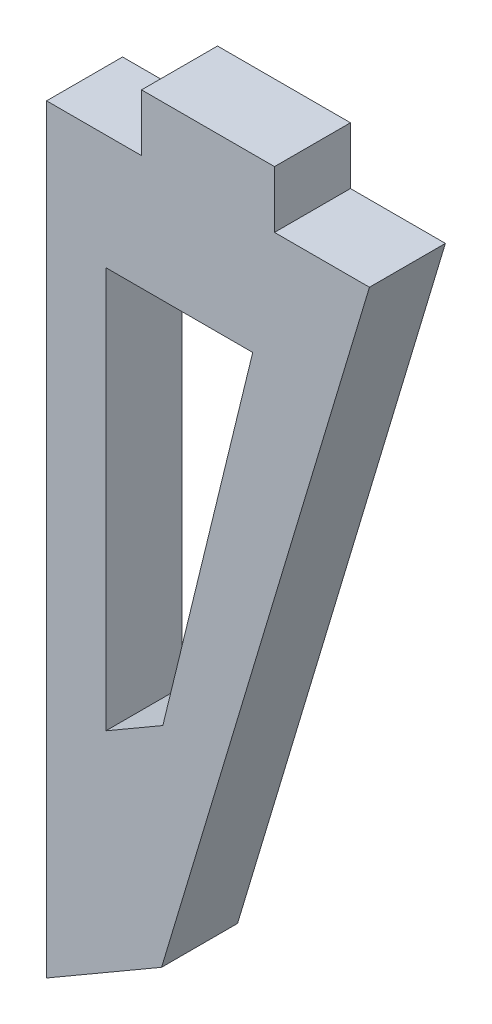
ISO-10303-21;
HEADER;
FILE_DESCRIPTION(('STEP AP214'),'2;1');
FILE_NAME('part.step','',(''),(''),'','','');
FILE_SCHEMA(('AUTOMOTIVE_DESIGN { 1 0 10303 214 1 1 1 1 }'));
ENDSEC;
DATA;
#1=APPLICATION_CONTEXT('core data for automotive mechanical design processes');
#2=APPLICATION_PROTOCOL_DEFINITION('international standard','automotive_design',2000,#1);
#3=PRODUCT_CONTEXT('',#1,'mechanical');
#4=PRODUCT('Part','Part','',(#3));
#5=PRODUCT_RELATED_PRODUCT_CATEGORY('part','',(#4));
#6=PRODUCT_DEFINITION_FORMATION('','',#4);
#7=PRODUCT_DEFINITION_CONTEXT('part definition',#1,'design');
#8=PRODUCT_DEFINITION('design','',#6,#7);
#9=PRODUCT_DEFINITION_SHAPE('','',#8);
#10=(LENGTH_UNIT() NAMED_UNIT(*) SI_UNIT(.MILLI.,.METRE.));
#11=(NAMED_UNIT(*) PLANE_ANGLE_UNIT() SI_UNIT($,.RADIAN.));
#12=(NAMED_UNIT(*) SI_UNIT($,.STERADIAN.) SOLID_ANGLE_UNIT());
#13=UNCERTAINTY_MEASURE_WITH_UNIT(LENGTH_MEASURE(1.E-05),#10,'distance_accuracy_value','');
#14=(GEOMETRIC_REPRESENTATION_CONTEXT(3) GLOBAL_UNCERTAINTY_ASSIGNED_CONTEXT((#13)) GLOBAL_UNIT_ASSIGNED_CONTEXT((#10,
#11,#12)) REPRESENTATION_CONTEXT('',''));
#15=CARTESIAN_POINT('',(0.,0.,0.));
#16=DIRECTION('',(0.,0.,1.));
#17=DIRECTION('',(1.,0.,0.));
#18=AXIS2_PLACEMENT_3D('',#15,#16,#17);
#19=CARTESIAN_POINT('',(0.,0.,2.));
#20=DIRECTION('',(0.,0.,-1.));
#21=DIRECTION('',(-1.,0.,0.));
#22=AXIS2_PLACEMENT_3D('',#19,#20,#21);
#23=PLANE('',#22);
#24=DIRECTION('',(-1.,0.,0.));
#25=VECTOR('',#24,1.);
#26=CARTESIAN_POINT('',(0.,0.,2.));
#27=LINE('',#26,#25);
#28=CARTESIAN_POINT('',(0.,0.,2.));
#29=VERTEX_POINT('',#28);
#30=CARTESIAN_POINT('',(-2.5,0.,2.));
#31=VERTEX_POINT('',#30);
#32=EDGE_CURVE('E156',#29,#31,#27,.T.);
#33=ORIENTED_EDGE('',*,*,#32,.T.);
#34=DIRECTION('',(0.,1.,0.));
#35=VECTOR('',#34,1.);
#36=CARTESIAN_POINT('',(-2.5,0.,2.));
#37=LINE('',#36,#35);
#38=CARTESIAN_POINT('',(-2.5,1.5,2.));
#39=VERTEX_POINT('',#38);
#40=EDGE_CURVE('E159',#31,#39,#37,.T.);
#41=ORIENTED_EDGE('',*,*,#40,.T.);
#42=DIRECTION('',(-1.,0.,0.));
#43=VECTOR('',#42,1.);
#44=CARTESIAN_POINT('',(-2.5,1.5,2.));
#45=LINE('',#44,#43);
#46=CARTESIAN_POINT('',(-6.,1.5,2.));
#47=VERTEX_POINT('',#46);
#48=EDGE_CURVE('E162',#39,#47,#45,.T.);
#49=ORIENTED_EDGE('',*,*,#48,.T.);
#50=DIRECTION('',(0.,-1.,0.));
#51=VECTOR('',#50,1.);
#52=CARTESIAN_POINT('',(-6.,1.5,2.));
#53=LINE('',#52,#51);
#54=CARTESIAN_POINT('',(-6.,0.,2.));
#55=VERTEX_POINT('',#54);
#56=EDGE_CURVE('E164',#47,#55,#53,.T.);
#57=ORIENTED_EDGE('',*,*,#56,.T.);
#58=DIRECTION('',(-1.,0.,0.));
#59=VECTOR('',#58,1.);
#60=CARTESIAN_POINT('',(-6.,0.,2.));
#61=LINE('',#60,#59);
#62=CARTESIAN_POINT('',(-8.5,0.,2.));
#63=VERTEX_POINT('',#62);
#64=EDGE_CURVE('E166',#55,#63,#61,.T.);
#65=ORIENTED_EDGE('',*,*,#64,.T.);
#66=DIRECTION('',(0.,-1.,0.));
#67=VECTOR('',#66,1.);
#68=CARTESIAN_POINT('',(-8.5,0.,2.));
#69=LINE('',#68,#67);
#70=CARTESIAN_POINT('',(-8.5,-20.,2.));
#71=VERTEX_POINT('',#70);
#72=EDGE_CURVE('E168',#63,#71,#69,.T.);
#73=ORIENTED_EDGE('',*,*,#72,.T.);
#74=DIRECTION('',(0.864879548695724,0.501979448033365,0.));
#75=VECTOR('',#74,1.);
#76=CARTESIAN_POINT('',(-8.5,-20.,2.));
#77=LINE('',#76,#75);
#78=CARTESIAN_POINT('',(-5.47292157956496,-18.2430719318832,2.));
#79=VERTEX_POINT('',#78);
#80=EDGE_CURVE('E170',#71,#79,#77,.T.);
#81=ORIENTED_EDGE('',*,*,#80,.T.);
#82=DIRECTION('',(0.287347885566345,0.957826285221151,0.));
#83=VECTOR('',#82,1.);
#84=CARTESIAN_POINT('',(-5.47292157956496,-18.2430719318832,2.));
#85=LINE('',#84,#83);
#86=EDGE_CURVE('E172',#79,#29,#85,.T.);
#87=ORIENTED_EDGE('',*,*,#86,.T.);
#88=EDGE_LOOP('',(#33,#41,#49,#57,#65,#73,#81,#87));
#89=FACE_BOUND('',#88,.T.);
#90=DIRECTION('',(0.864879548695724,0.501979448033364,0.));
#91=VECTOR('',#90,1.);
#92=CARTESIAN_POINT('',(-5.43936266359136,-12.7131199841732,2.));
#93=LINE('',#92,#91);
#94=CARTESIAN_POINT('',(-6.93936266359137,-13.5837258080542,2.));
#95=VERTEX_POINT('',#94);
#96=CARTESIAN_POINT('',(-5.43936266359136,-12.7131199841732,2.));
#97=VERTEX_POINT('',#96);
#98=EDGE_CURVE('E123',#95,#97,#93,.T.);
#99=ORIENTED_EDGE('',*,*,#98,.F.);
#100=DIRECTION('',(0.,-1.,0.));
#101=VECTOR('',#100,1.);
#102=CARTESIAN_POINT('',(-6.93936266359137,-12.7131199841732,2.));
#103=LINE('',#102,#101);
#104=CARTESIAN_POINT('',(-6.93936266359137,-3.02357713944242,2.));
#105=VERTEX_POINT('',#104);
#106=EDGE_CURVE('E118',#105,#95,#103,.T.);
#107=ORIENTED_EDGE('',*,*,#106,.F.);
#108=DIRECTION('',(-1.,0.,0.));
#109=VECTOR('',#108,1.);
#110=CARTESIAN_POINT('',(-3.0730418497342,-3.02357713944242,2.));
#111=LINE('',#110,#109);
#112=CARTESIAN_POINT('',(-3.0730418497342,-3.02357713944242,2.));
#113=VERTEX_POINT('',#112);
#114=EDGE_CURVE('E139',#113,#105,#111,.T.);
#115=ORIENTED_EDGE('',*,*,#114,.F.);
#116=DIRECTION('',(0.23724172811653,0.971450648484154,0.));
#117=VECTOR('',#116,1.);
#118=CARTESIAN_POINT('',(-3.43936266359137,-4.52357713944242,2.));
#119=LINE('',#118,#117);
#120=EDGE_CURVE('E137',#97,#113,#119,.T.);
#121=ORIENTED_EDGE('',*,*,#120,.F.);
#122=EDGE_LOOP('',(#99,#107,#115,#121));
#123=FACE_BOUND('',#122,.T.);
#124=ADVANCED_FACE('F32',(#89,#123),#23,.F.);
#125=CARTESIAN_POINT('',(0.,0.,0.));
#126=DIRECTION('',(0.,0.,-1.));
#127=DIRECTION('',(-1.,0.,0.));
#128=AXIS2_PLACEMENT_3D('',#125,#126,#127);
#129=PLANE('',#128);
#130=DIRECTION('',(-1.,0.,0.));
#131=VECTOR('',#130,1.);
#132=CARTESIAN_POINT('',(0.,0.,0.));
#133=LINE('',#132,#131);
#134=CARTESIAN_POINT('',(0.,0.,0.));
#135=VERTEX_POINT('',#134);
#136=CARTESIAN_POINT('',(-2.5,0.,0.));
#137=VERTEX_POINT('',#136);
#138=EDGE_CURVE('E133',#135,#137,#133,.T.);
#139=ORIENTED_EDGE('',*,*,#138,.F.);
#140=DIRECTION('',(0.287347885566345,0.957826285221151,0.));
#141=VECTOR('',#140,1.);
#142=CARTESIAN_POINT('',(-5.47292157956496,-18.2430719318832,0.));
#143=LINE('',#142,#141);
#144=CARTESIAN_POINT('',(-5.47292157956496,-18.2430719318832,0.));
#145=VERTEX_POINT('',#144);
#146=EDGE_CURVE('E160',#145,#135,#143,.T.);
#147=ORIENTED_EDGE('',*,*,#146,.F.);
#148=DIRECTION('',(0.864879548695724,0.501979448033365,0.));
#149=VECTOR('',#148,1.);
#150=CARTESIAN_POINT('',(-8.5,-20.,0.));
#151=LINE('',#150,#149);
#152=CARTESIAN_POINT('',(-8.5,-20.,0.));
#153=VERTEX_POINT('',#152);
#154=EDGE_CURVE('E187',#153,#145,#151,.T.);
#155=ORIENTED_EDGE('',*,*,#154,.F.);
#156=DIRECTION('',(0.,-1.,0.));
#157=VECTOR('',#156,1.);
#158=CARTESIAN_POINT('',(-8.5,0.,0.));
#159=LINE('',#158,#157);
#160=CARTESIAN_POINT('',(-8.5,0.,0.));
#161=VERTEX_POINT('',#160);
#162=EDGE_CURVE('E185',#161,#153,#159,.T.);
#163=ORIENTED_EDGE('',*,*,#162,.F.);
#164=DIRECTION('',(-1.,0.,0.));
#165=VECTOR('',#164,1.);
#166=CARTESIAN_POINT('',(-6.,0.,0.));
#167=LINE('',#166,#165);
#168=CARTESIAN_POINT('',(-6.,0.,0.));
#169=VERTEX_POINT('',#168);
#170=EDGE_CURVE('E183',#169,#161,#167,.T.);
#171=ORIENTED_EDGE('',*,*,#170,.F.);
#172=DIRECTION('',(0.,-1.,0.));
#173=VECTOR('',#172,1.);
#174=CARTESIAN_POINT('',(-6.,1.5,0.));
#175=LINE('',#174,#173);
#176=CARTESIAN_POINT('',(-6.,1.5,0.));
#177=VERTEX_POINT('',#176);
#178=EDGE_CURVE('E181',#177,#169,#175,.T.);
#179=ORIENTED_EDGE('',*,*,#178,.F.);
#180=DIRECTION('',(-1.,0.,0.));
#181=VECTOR('',#180,1.);
#182=CARTESIAN_POINT('',(-2.5,1.5,0.));
#183=LINE('',#182,#181);
#184=CARTESIAN_POINT('',(-2.5,1.5,0.));
#185=VERTEX_POINT('',#184);
#186=EDGE_CURVE('E179',#185,#177,#183,.T.);
#187=ORIENTED_EDGE('',*,*,#186,.F.);
#188=DIRECTION('',(0.,1.,0.));
#189=VECTOR('',#188,1.);
#190=CARTESIAN_POINT('',(-2.5,0.,0.));
#191=LINE('',#190,#189);
#192=EDGE_CURVE('E177',#137,#185,#191,.T.);
#193=ORIENTED_EDGE('',*,*,#192,.F.);
#194=EDGE_LOOP('',(#139,#147,#155,#163,#171,#179,#187,#193));
#195=FACE_BOUND('',#194,.T.);
#196=DIRECTION('',(0.,-1.,0.));
#197=VECTOR('',#196,1.);
#198=CARTESIAN_POINT('',(-6.93936266359137,-11.7131199841732,0.));
#199=LINE('',#198,#197);
#200=CARTESIAN_POINT('',(-6.93936266359137,-3.02357713944242,0.));
#201=VERTEX_POINT('',#200);
#202=CARTESIAN_POINT('',(-6.93936266359137,-13.5837258080542,0.));
#203=VERTEX_POINT('',#202);
#204=EDGE_CURVE('E124',#201,#203,#199,.T.);
#205=ORIENTED_EDGE('',*,*,#204,.T.);
#206=DIRECTION('',(0.864879548695724,0.501979448033364,0.));
#207=VECTOR('',#206,1.);
#208=CARTESIAN_POINT('',(-5.43936266359136,-12.7131199841732,0.));
#209=LINE('',#208,#207);
#210=CARTESIAN_POINT('',(-5.43936266359136,-12.7131199841732,0.));
#211=VERTEX_POINT('',#210);
#212=EDGE_CURVE('E131',#203,#211,#209,.T.);
#213=ORIENTED_EDGE('',*,*,#212,.T.);
#214=DIRECTION('',(0.23724172811653,0.971450648484154,0.));
#215=VECTOR('',#214,1.);
#216=CARTESIAN_POINT('',(-3.43936266359137,-4.52357713944242,0.));
#217=LINE('',#216,#215);
#218=CARTESIAN_POINT('',(-3.0730418497342,-3.02357713944242,0.));
#219=VERTEX_POINT('',#218);
#220=EDGE_CURVE('E144',#211,#219,#217,.T.);
#221=ORIENTED_EDGE('',*,*,#220,.T.);
#222=DIRECTION('',(-1.,0.,0.));
#223=VECTOR('',#222,1.);
#224=CARTESIAN_POINT('',(-3.4393626635914,-3.02357713944242,0.));
#225=LINE('',#224,#223);
#226=EDGE_CURVE('E147',#219,#201,#225,.T.);
#227=ORIENTED_EDGE('',*,*,#226,.T.);
#228=EDGE_LOOP('',(#205,#213,#221,#227));
#229=FACE_BOUND('',#228,.T.);
#230=ADVANCED_FACE('F217',(#195,#229),#129,.T.);
#231=CARTESIAN_POINT('',(0.,0.,2.));
#232=DIRECTION('',(0.,-1.,0.));
#233=DIRECTION('',(1.,0.,0.));
#234=AXIS2_PLACEMENT_3D('',#231,#232,#233);
#235=PLANE('',#234);
#236=ORIENTED_EDGE('',*,*,#138,.T.);
#237=DIRECTION('',(0.,0.,-1.));
#238=VECTOR('',#237,1.);
#239=CARTESIAN_POINT('',(-2.5,0.,2.));
#240=LINE('',#239,#238);
#241=EDGE_CURVE('E11',#31,#137,#240,.T.);
#242=ORIENTED_EDGE('',*,*,#241,.F.);
#243=ORIENTED_EDGE('',*,*,#32,.F.);
#244=DIRECTION('',(0.,0.,-1.));
#245=VECTOR('',#244,1.);
#246=CARTESIAN_POINT('',(0.,0.,2.));
#247=LINE('',#246,#245);
#248=EDGE_CURVE('E174',#29,#135,#247,.T.);
#249=ORIENTED_EDGE('',*,*,#248,.T.);
#250=EDGE_LOOP('',(#236,#242,#243,#249));
#251=FACE_BOUND('',#250,.T.);
#252=ADVANCED_FACE('F34',(#251),#235,.F.);
#253=CARTESIAN_POINT('',(-2.5,0.,2.));
#254=DIRECTION('',(-1.,0.,0.));
#255=DIRECTION('',(0.,0.,1.));
#256=AXIS2_PLACEMENT_3D('',#253,#254,#255);
#257=PLANE('',#256);
#258=ORIENTED_EDGE('',*,*,#192,.T.);
#259=DIRECTION('',(0.,0.,-1.));
#260=VECTOR('',#259,1.);
#261=CARTESIAN_POINT('',(-2.5,1.5,2.));
#262=LINE('',#261,#260);
#263=EDGE_CURVE('E40',#39,#185,#262,.T.);
#264=ORIENTED_EDGE('',*,*,#263,.F.);
#265=ORIENTED_EDGE('',*,*,#40,.F.);
#266=ORIENTED_EDGE('',*,*,#241,.T.);
#267=EDGE_LOOP('',(#258,#264,#265,#266));
#268=FACE_BOUND('',#267,.T.);
#269=ADVANCED_FACE('F234',(#268),#257,.F.);
#270=CARTESIAN_POINT('',(-2.5,1.5,2.));
#271=DIRECTION('',(0.,-1.,0.));
#272=DIRECTION('',(1.,0.,0.));
#273=AXIS2_PLACEMENT_3D('',#270,#271,#272);
#274=PLANE('',#273);
#275=ORIENTED_EDGE('',*,*,#186,.T.);
#276=DIRECTION('',(0.,0.,-1.));
#277=VECTOR('',#276,1.);
#278=CARTESIAN_POINT('',(-6.,1.5,2.));
#279=LINE('',#278,#277);
#280=EDGE_CURVE('E204',#47,#177,#279,.T.);
#281=ORIENTED_EDGE('',*,*,#280,.F.);
#282=ORIENTED_EDGE('',*,*,#48,.F.);
#283=ORIENTED_EDGE('',*,*,#263,.T.);
#284=EDGE_LOOP('',(#275,#281,#282,#283));
#285=FACE_BOUND('',#284,.T.);
#286=ADVANCED_FACE('F211',(#285),#274,.F.);
#287=CARTESIAN_POINT('',(-6.,1.5,2.));
#288=DIRECTION('',(1.,0.,0.));
#289=DIRECTION('',(0.,0.,-1.));
#290=AXIS2_PLACEMENT_3D('',#287,#288,#289);
#291=PLANE('',#290);
#292=ORIENTED_EDGE('',*,*,#178,.T.);
#293=DIRECTION('',(0.,0.,-1.));
#294=VECTOR('',#293,1.);
#295=CARTESIAN_POINT('',(-6.,0.,2.));
#296=LINE('',#295,#294);
#297=EDGE_CURVE('E201',#55,#169,#296,.T.);
#298=ORIENTED_EDGE('',*,*,#297,.F.);
#299=ORIENTED_EDGE('',*,*,#56,.F.);
#300=ORIENTED_EDGE('',*,*,#280,.T.);
#301=EDGE_LOOP('',(#292,#298,#299,#300));
#302=FACE_BOUND('',#301,.T.);
#303=ADVANCED_FACE('F223',(#302),#291,.F.);
#304=CARTESIAN_POINT('',(-6.,0.,2.));
#305=DIRECTION('',(0.,-1.,0.));
#306=DIRECTION('',(1.,0.,0.));
#307=AXIS2_PLACEMENT_3D('',#304,#305,#306);
#308=PLANE('',#307);
#309=ORIENTED_EDGE('',*,*,#170,.T.);
#310=DIRECTION('',(0.,0.,-1.));
#311=VECTOR('',#310,1.);
#312=CARTESIAN_POINT('',(-8.5,0.,2.));
#313=LINE('',#312,#311);
#314=EDGE_CURVE('E198',#63,#161,#313,.T.);
#315=ORIENTED_EDGE('',*,*,#314,.F.);
#316=ORIENTED_EDGE('',*,*,#64,.F.);
#317=ORIENTED_EDGE('',*,*,#297,.T.);
#318=EDGE_LOOP('',(#309,#315,#316,#317));
#319=FACE_BOUND('',#318,.T.);
#320=ADVANCED_FACE('F227',(#319),#308,.F.);
#321=CARTESIAN_POINT('',(-8.5,0.,2.));
#322=DIRECTION('',(1.,0.,0.));
#323=DIRECTION('',(0.,1.,0.));
#324=AXIS2_PLACEMENT_3D('',#321,#322,#323);
#325=PLANE('',#324);
#326=ORIENTED_EDGE('',*,*,#162,.T.);
#327=DIRECTION('',(0.,0.,-1.));
#328=VECTOR('',#327,1.);
#329=CARTESIAN_POINT('',(-8.5,-20.,2.));
#330=LINE('',#329,#328);
#331=EDGE_CURVE('E195',#71,#153,#330,.T.);
#332=ORIENTED_EDGE('',*,*,#331,.F.);
#333=ORIENTED_EDGE('',*,*,#72,.F.);
#334=ORIENTED_EDGE('',*,*,#314,.T.);
#335=EDGE_LOOP('',(#326,#332,#333,#334));
#336=FACE_BOUND('',#335,.T.);
#337=ADVANCED_FACE('F247',(#336),#325,.F.);
#338=CARTESIAN_POINT('',(-8.5,-20.,2.));
#339=DIRECTION('',(-0.501979448033365,0.864879548695724,0.));
#340=DIRECTION('',(-0.864879548695724,-0.501979448033365,0.));
#341=AXIS2_PLACEMENT_3D('',#338,#339,#340);
#342=PLANE('',#341);
#343=ORIENTED_EDGE('',*,*,#154,.T.);
#344=DIRECTION('',(0.,0.,-1.));
#345=VECTOR('',#344,1.);
#346=CARTESIAN_POINT('',(-5.47292157956496,-18.2430719318832,2.));
#347=LINE('',#346,#345);
#348=EDGE_CURVE('E192',#79,#145,#347,.T.);
#349=ORIENTED_EDGE('',*,*,#348,.F.);
#350=ORIENTED_EDGE('',*,*,#80,.F.);
#351=ORIENTED_EDGE('',*,*,#331,.T.);
#352=EDGE_LOOP('',(#343,#349,#350,#351));
#353=FACE_BOUND('',#352,.T.);
#354=ADVANCED_FACE('F245',(#353),#342,.F.);
#355=CARTESIAN_POINT('',(-5.47292157956496,-18.2430719318832,2.));
#356=DIRECTION('',(-0.957826285221151,0.287347885566345,0.));
#357=DIRECTION('',(-0.287347885566345,-0.957826285221151,0.));
#358=AXIS2_PLACEMENT_3D('',#355,#356,#357);
#359=PLANE('',#358);
#360=ORIENTED_EDGE('',*,*,#146,.T.);
#361=ORIENTED_EDGE('',*,*,#248,.F.);
#362=ORIENTED_EDGE('',*,*,#86,.F.);
#363=ORIENTED_EDGE('',*,*,#348,.T.);
#364=EDGE_LOOP('',(#360,#361,#362,#363));
#365=FACE_BOUND('',#364,.T.);
#366=ADVANCED_FACE('F240',(#365),#359,.F.);
#367=CARTESIAN_POINT('',(-5.43936266359136,-12.7131199841732,2.));
#368=DIRECTION('',(-0.501979448033364,0.864879548695724,0.));
#369=DIRECTION('',(-0.864879548695724,-0.501979448033364,0.));
#370=AXIS2_PLACEMENT_3D('',#367,#368,#369);
#371=PLANE('',#370);
#372=ORIENTED_EDGE('',*,*,#212,.F.);
#373=DIRECTION('',(0.,0.,-1.));
#374=VECTOR('',#373,1.);
#375=CARTESIAN_POINT('',(-6.93936266359137,-13.5837258080542,2.));
#376=LINE('',#375,#374);
#377=EDGE_CURVE('E52',#95,#203,#376,.T.);
#378=ORIENTED_EDGE('',*,*,#377,.F.);
#379=ORIENTED_EDGE('',*,*,#98,.T.);
#380=DIRECTION('',(0.,0.,-1.));
#381=VECTOR('',#380,1.);
#382=CARTESIAN_POINT('',(-5.43936266359136,-12.7131199841732,2.));
#383=LINE('',#382,#381);
#384=EDGE_CURVE('E134',#97,#211,#383,.T.);
#385=ORIENTED_EDGE('',*,*,#384,.T.);
#386=EDGE_LOOP('',(#372,#378,#379,#385));
#387=FACE_BOUND('',#386,.T.);
#388=ADVANCED_FACE('F127',(#387),#371,.T.);
#389=CARTESIAN_POINT('',(-3.43936266359137,-4.52357713944242,2.));
#390=DIRECTION('',(-0.971450648484154,0.23724172811653,0.));
#391=DIRECTION('',(-0.23724172811653,-0.971450648484154,0.));
#392=AXIS2_PLACEMENT_3D('',#389,#390,#391);
#393=PLANE('',#392);
#394=ORIENTED_EDGE('',*,*,#220,.F.);
#395=ORIENTED_EDGE('',*,*,#384,.F.);
#396=ORIENTED_EDGE('',*,*,#120,.T.);
#397=DIRECTION('',(0.,0.,-1.));
#398=VECTOR('',#397,1.);
#399=CARTESIAN_POINT('',(-3.0730418497342,-3.02357713944242,2.));
#400=LINE('',#399,#398);
#401=EDGE_CURVE('E152',#113,#219,#400,.T.);
#402=ORIENTED_EDGE('',*,*,#401,.T.);
#403=EDGE_LOOP('',(#394,#395,#396,#402));
#404=FACE_BOUND('',#403,.T.);
#405=ADVANCED_FACE('F269',(#404),#393,.T.);
#406=CARTESIAN_POINT('',(-3.4393626635914,-3.02357713944242,2.));
#407=DIRECTION('',(0.,-1.,0.));
#408=DIRECTION('',(1.,0.,0.));
#409=AXIS2_PLACEMENT_3D('',#406,#407,#408);
#410=PLANE('',#409);
#411=ORIENTED_EDGE('',*,*,#226,.F.);
#412=ORIENTED_EDGE('',*,*,#401,.F.);
#413=ORIENTED_EDGE('',*,*,#114,.T.);
#414=DIRECTION('',(0.,0.,-1.));
#415=VECTOR('',#414,1.);
#416=CARTESIAN_POINT('',(-6.93936266359137,-3.02357713944242,2.));
#417=LINE('',#416,#415);
#418=EDGE_CURVE('E47',#105,#201,#417,.T.);
#419=ORIENTED_EDGE('',*,*,#418,.T.);
#420=EDGE_LOOP('',(#411,#412,#413,#419));
#421=FACE_BOUND('',#420,.T.);
#422=ADVANCED_FACE('F273',(#421),#410,.T.);
#423=CARTESIAN_POINT('',(-6.93936266359137,-11.7131199841732,2.));
#424=DIRECTION('',(1.,0.,0.));
#425=DIRECTION('',(0.,0.,-1.));
#426=AXIS2_PLACEMENT_3D('',#423,#424,#425);
#427=PLANE('',#426);
#428=ORIENTED_EDGE('',*,*,#204,.F.);
#429=ORIENTED_EDGE('',*,*,#418,.F.);
#430=ORIENTED_EDGE('',*,*,#106,.T.);
#431=ORIENTED_EDGE('',*,*,#377,.T.);
#432=EDGE_LOOP('',(#428,#429,#430,#431));
#433=FACE_BOUND('',#432,.T.);
#434=ADVANCED_FACE('F119',(#433),#427,.T.);
#435=CLOSED_SHELL('',(#124,#230,#252,#269,#286,#303,#320,#337,#354,#366,#388,#405,#422,#434));
#436=MANIFOLD_SOLID_BREP('B2',#435);
#437=ADVANCED_BREP_SHAPE_REPRESENTATION('',(#18,#436),#14);
#438=SHAPE_DEFINITION_REPRESENTATION(#9,#437);
ENDSEC;
END-ISO-10303-21;
